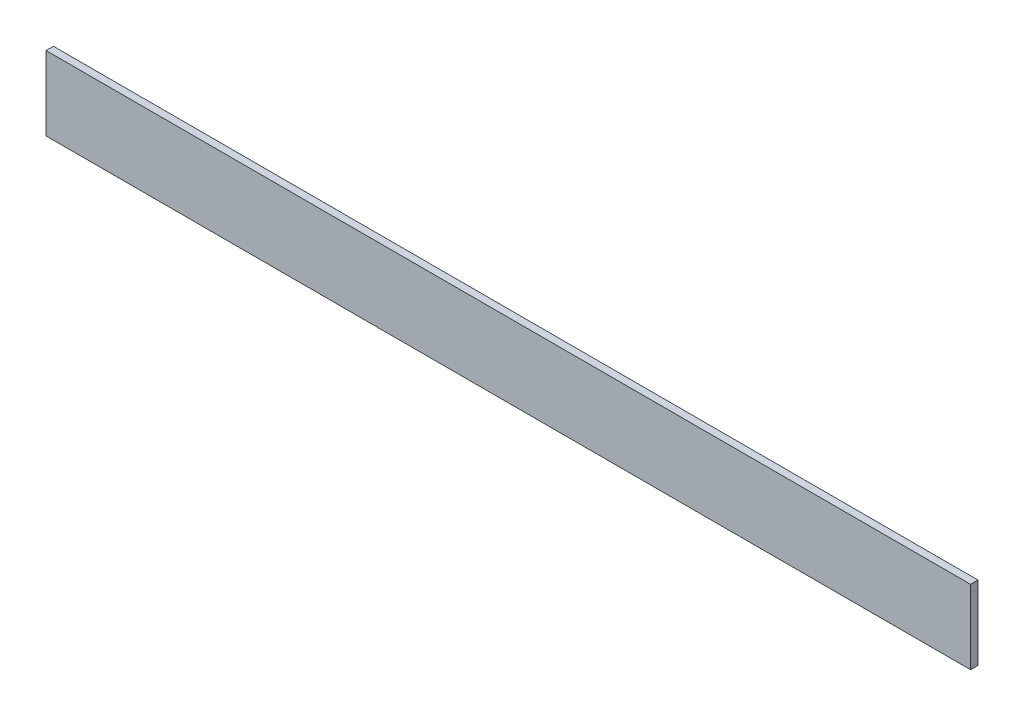
ISO-10303-21;
HEADER;
FILE_DESCRIPTION(('STEP AP214'),'2;1');
FILE_NAME('part.step','',(''),(''),'','','');
FILE_SCHEMA(('AUTOMOTIVE_DESIGN { 1 0 10303 214 1 1 1 1 }'));
ENDSEC;
DATA;
#1=APPLICATION_CONTEXT('core data for automotive mechanical design processes');
#2=APPLICATION_PROTOCOL_DEFINITION('international standard','automotive_design',2000,#1);
#3=PRODUCT_CONTEXT('',#1,'mechanical');
#4=PRODUCT('Part','Part','',(#3));
#5=PRODUCT_RELATED_PRODUCT_CATEGORY('part','',(#4));
#6=PRODUCT_DEFINITION_FORMATION('','',#4);
#7=PRODUCT_DEFINITION_CONTEXT('part definition',#1,'design');
#8=PRODUCT_DEFINITION('design','',#6,#7);
#9=PRODUCT_DEFINITION_SHAPE('','',#8);
#10=(LENGTH_UNIT() NAMED_UNIT(*) SI_UNIT(.MILLI.,.METRE.));
#11=(NAMED_UNIT(*) PLANE_ANGLE_UNIT() SI_UNIT($,.RADIAN.));
#12=(NAMED_UNIT(*) SI_UNIT($,.STERADIAN.) SOLID_ANGLE_UNIT());
#13=UNCERTAINTY_MEASURE_WITH_UNIT(LENGTH_MEASURE(1.E-05),#10,'distance_accuracy_value','');
#14=(GEOMETRIC_REPRESENTATION_CONTEXT(3) GLOBAL_UNCERTAINTY_ASSIGNED_CONTEXT((#13)) GLOBAL_UNIT_ASSIGNED_CONTEXT((#10,
#11,#12)) REPRESENTATION_CONTEXT('',''));
#15=CARTESIAN_POINT('',(0.,0.,0.));
#16=DIRECTION('',(0.,0.,1.));
#17=DIRECTION('',(1.,0.,0.));
#18=AXIS2_PLACEMENT_3D('',#15,#16,#17);
#19=CARTESIAN_POINT('',(0.,0.,-8.));
#20=DIRECTION('',(-1.,0.,0.));
#21=DIRECTION('',(0.,-1.,0.));
#22=AXIS2_PLACEMENT_3D('',#19,#20,#21);
#23=PLANE('',#22);
#24=DIRECTION('',(0.,-1.,0.));
#25=VECTOR('',#24,1.);
#26=CARTESIAN_POINT('',(0.,0.,0.));
#27=LINE('',#26,#25);
#28=CARTESIAN_POINT('',(0.,0.,0.));
#29=VERTEX_POINT('',#28);
#30=CARTESIAN_POINT('',(0.,-80.,0.));
#31=VERTEX_POINT('',#30);
#32=EDGE_CURVE('E106',#29,#31,#27,.T.);
#33=ORIENTED_EDGE('',*,*,#32,.F.);
#34=DIRECTION('',(0.,0.,1.));
#35=VECTOR('',#34,1.);
#36=CARTESIAN_POINT('',(0.,0.,-8.));
#37=LINE('',#36,#35);
#38=CARTESIAN_POINT('',(0.,0.,-8.));
#39=VERTEX_POINT('',#38);
#40=EDGE_CURVE('E11',#39,#29,#37,.T.);
#41=ORIENTED_EDGE('',*,*,#40,.F.);
#42=DIRECTION('',(0.,-1.,0.));
#43=VECTOR('',#42,1.);
#44=CARTESIAN_POINT('',(0.,0.,-8.));
#45=LINE('',#44,#43);
#46=CARTESIAN_POINT('',(0.,-80.,-8.));
#47=VERTEX_POINT('',#46);
#48=EDGE_CURVE('E100',#39,#47,#45,.T.);
#49=ORIENTED_EDGE('',*,*,#48,.T.);
#50=DIRECTION('',(0.,0.,1.));
#51=VECTOR('',#50,1.);
#52=CARTESIAN_POINT('',(0.,-80.,-8.));
#53=LINE('',#52,#51);
#54=EDGE_CURVE('E45',#47,#31,#53,.T.);
#55=ORIENTED_EDGE('',*,*,#54,.T.);
#56=EDGE_LOOP('',(#33,#41,#49,#55));
#57=FACE_BOUND('',#56,.T.);
#58=ADVANCED_FACE('F42',(#57),#23,.T.);
#59=CARTESIAN_POINT('',(0.,0.,-8.));
#60=DIRECTION('',(0.,1.,0.));
#61=DIRECTION('',(0.,0.,1.));
#62=AXIS2_PLACEMENT_3D('',#59,#60,#61);
#63=PLANE('',#62);
#64=DIRECTION('',(-1.,0.,0.));
#65=VECTOR('',#64,1.);
#66=CARTESIAN_POINT('',(0.,0.,0.));
#67=LINE('',#66,#65);
#68=CARTESIAN_POINT('',(1000.,0.,0.));
#69=VERTEX_POINT('',#68);
#70=EDGE_CURVE('E102',#69,#29,#67,.T.);
#71=ORIENTED_EDGE('',*,*,#70,.F.);
#72=DIRECTION('',(0.,0.,1.));
#73=VECTOR('',#72,1.);
#74=CARTESIAN_POINT('',(1000.,0.,-8.));
#75=LINE('',#74,#73);
#76=CARTESIAN_POINT('',(1000.,0.,-8.));
#77=VERTEX_POINT('',#76);
#78=EDGE_CURVE('E51',#77,#69,#75,.T.);
#79=ORIENTED_EDGE('',*,*,#78,.F.);
#80=DIRECTION('',(-1.,0.,0.));
#81=VECTOR('',#80,1.);
#82=CARTESIAN_POINT('',(0.,0.,-8.));
#83=LINE('',#82,#81);
#84=EDGE_CURVE('E97',#77,#39,#83,.T.);
#85=ORIENTED_EDGE('',*,*,#84,.T.);
#86=ORIENTED_EDGE('',*,*,#40,.T.);
#87=EDGE_LOOP('',(#71,#79,#85,#86));
#88=FACE_BOUND('',#87,.T.);
#89=ADVANCED_FACE('F116',(#88),#63,.T.);
#90=CARTESIAN_POINT('',(1000.,0.,-8.));
#91=DIRECTION('',(1.,0.,0.));
#92=DIRECTION('',(0.,0.,-1.));
#93=AXIS2_PLACEMENT_3D('',#90,#91,#92);
#94=PLANE('',#93);
#95=DIRECTION('',(0.,1.,0.));
#96=VECTOR('',#95,1.);
#97=CARTESIAN_POINT('',(1000.,0.,0.));
#98=LINE('',#97,#96);
#99=CARTESIAN_POINT('',(1000.,-80.,0.));
#100=VERTEX_POINT('',#99);
#101=EDGE_CURVE('E92',#100,#69,#98,.T.);
#102=ORIENTED_EDGE('',*,*,#101,.F.);
#103=DIRECTION('',(0.,0.,1.));
#104=VECTOR('',#103,1.);
#105=CARTESIAN_POINT('',(1000.,-80.,-8.));
#106=LINE('',#105,#104);
#107=CARTESIAN_POINT('',(1000.,-80.,-8.));
#108=VERTEX_POINT('',#107);
#109=EDGE_CURVE('E87',#108,#100,#106,.T.);
#110=ORIENTED_EDGE('',*,*,#109,.F.);
#111=DIRECTION('',(0.,1.,0.));
#112=VECTOR('',#111,1.);
#113=CARTESIAN_POINT('',(1000.,0.,-8.));
#114=LINE('',#113,#112);
#115=EDGE_CURVE('E90',#108,#77,#114,.T.);
#116=ORIENTED_EDGE('',*,*,#115,.T.);
#117=ORIENTED_EDGE('',*,*,#78,.T.);
#118=EDGE_LOOP('',(#102,#110,#116,#117));
#119=FACE_BOUND('',#118,.T.);
#120=ADVANCED_FACE('F89',(#119),#94,.T.);
#121=CARTESIAN_POINT('',(0.,-80.,-8.));
#122=DIRECTION('',(0.,-1.,0.));
#123=DIRECTION('',(0.,0.,-1.));
#124=AXIS2_PLACEMENT_3D('',#121,#122,#123);
#125=PLANE('',#124);
#126=DIRECTION('',(1.,0.,0.));
#127=VECTOR('',#126,1.);
#128=CARTESIAN_POINT('',(0.,-80.,0.));
#129=LINE('',#128,#127);
#130=EDGE_CURVE('E109',#31,#100,#129,.T.);
#131=ORIENTED_EDGE('',*,*,#130,.F.);
#132=ORIENTED_EDGE('',*,*,#54,.F.);
#133=DIRECTION('',(1.,0.,0.));
#134=VECTOR('',#133,1.);
#135=CARTESIAN_POINT('',(0.,-80.,-8.));
#136=LINE('',#135,#134);
#137=EDGE_CURVE('E96',#47,#108,#136,.T.);
#138=ORIENTED_EDGE('',*,*,#137,.T.);
#139=ORIENTED_EDGE('',*,*,#109,.T.);
#140=EDGE_LOOP('',(#131,#132,#138,#139));
#141=FACE_BOUND('',#140,.T.);
#142=ADVANCED_FACE('F99',(#141),#125,.T.);
#143=CARTESIAN_POINT('',(0.,0.,-8.));
#144=DIRECTION('',(0.,0.,1.));
#145=DIRECTION('',(1.,0.,0.));
#146=AXIS2_PLACEMENT_3D('',#143,#144,#145);
#147=PLANE('',#146);
#148=ORIENTED_EDGE('',*,*,#48,.F.);
#149=ORIENTED_EDGE('',*,*,#84,.F.);
#150=ORIENTED_EDGE('',*,*,#115,.F.);
#151=ORIENTED_EDGE('',*,*,#137,.F.);
#152=EDGE_LOOP('',(#148,#149,#150,#151));
#153=FACE_BOUND('',#152,.T.);
#154=ADVANCED_FACE('F95',(#153),#147,.F.);
#155=CARTESIAN_POINT('',(0.,0.,0.));
#156=DIRECTION('',(0.,0.,1.));
#157=DIRECTION('',(1.,0.,0.));
#158=AXIS2_PLACEMENT_3D('',#155,#156,#157);
#159=PLANE('',#158);
#160=ORIENTED_EDGE('',*,*,#32,.T.);
#161=ORIENTED_EDGE('',*,*,#130,.T.);
#162=ORIENTED_EDGE('',*,*,#101,.T.);
#163=ORIENTED_EDGE('',*,*,#70,.T.);
#164=EDGE_LOOP('',(#160,#161,#162,#163));
#165=FACE_BOUND('',#164,.T.);
#166=ADVANCED_FACE('F115',(#165),#159,.T.);
#167=CLOSED_SHELL('',(#58,#89,#120,#142,#154,#166));
#168=MANIFOLD_SOLID_BREP('B2',#167);
#169=ADVANCED_BREP_SHAPE_REPRESENTATION('',(#18,#168),#14);
#170=SHAPE_DEFINITION_REPRESENTATION(#9,#169);
ENDSEC;
END-ISO-10303-21;
